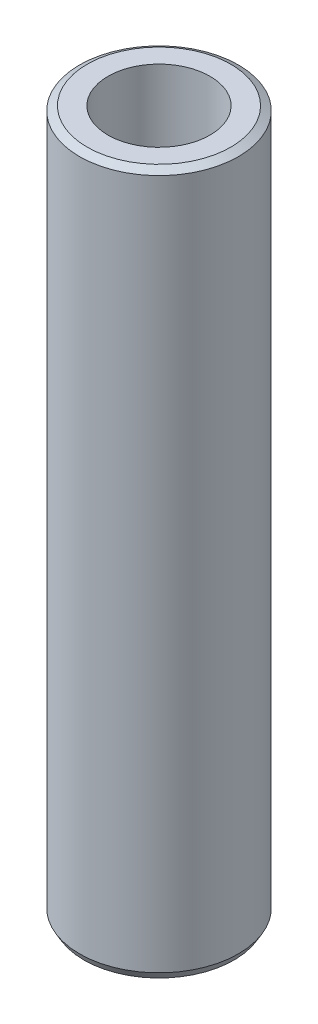
ISO-10303-21;
HEADER;
FILE_DESCRIPTION(('STEP AP214'),'2;1');
FILE_NAME('part.step','',(''),(''),'','','');
FILE_SCHEMA(('AUTOMOTIVE_DESIGN { 1 0 10303 214 1 1 1 1 }'));
ENDSEC;
DATA;
#1=APPLICATION_CONTEXT('core data for automotive mechanical design processes');
#2=APPLICATION_PROTOCOL_DEFINITION('international standard','automotive_design',2000,#1);
#3=PRODUCT_CONTEXT('',#1,'mechanical');
#4=PRODUCT('Part','Part','',(#3));
#5=PRODUCT_RELATED_PRODUCT_CATEGORY('part','',(#4));
#6=PRODUCT_DEFINITION_FORMATION('','',#4);
#7=PRODUCT_DEFINITION_CONTEXT('part definition',#1,'design');
#8=PRODUCT_DEFINITION('design','',#6,#7);
#9=PRODUCT_DEFINITION_SHAPE('','',#8);
#10=(LENGTH_UNIT() NAMED_UNIT(*) SI_UNIT(.MILLI.,.METRE.));
#11=(NAMED_UNIT(*) PLANE_ANGLE_UNIT() SI_UNIT($,.RADIAN.));
#12=(NAMED_UNIT(*) SI_UNIT($,.STERADIAN.) SOLID_ANGLE_UNIT());
#13=UNCERTAINTY_MEASURE_WITH_UNIT(LENGTH_MEASURE(1.E-05),#10,'distance_accuracy_value','');
#14=(GEOMETRIC_REPRESENTATION_CONTEXT(3) GLOBAL_UNCERTAINTY_ASSIGNED_CONTEXT((#13)) GLOBAL_UNIT_ASSIGNED_CONTEXT((#10,
#11,#12)) REPRESENTATION_CONTEXT('',''));
#15=CARTESIAN_POINT('',(0.,0.,0.));
#16=DIRECTION('',(0.,0.,1.));
#17=DIRECTION('',(1.,0.,0.));
#18=AXIS2_PLACEMENT_3D('',#15,#16,#17);
#19=CARTESIAN_POINT('',(0.,397.805296062061,0.));
#20=DIRECTION('',(0.,-1.,0.));
#21=DIRECTION('',(0.,0.,-1.));
#22=AXIS2_PLACEMENT_3D('',#19,#20,#21);
#23=CYLINDRICAL_SURFACE('',#22,45.);
#24=CARTESIAN_POINT('',(0.,395.316054538815,0.));
#25=DIRECTION('',(0.,1.,0.));
#26=DIRECTION('',(0.,0.,1.));
#27=AXIS2_PLACEMENT_3D('',#24,#25,#26);
#28=CIRCLE('',#27,45.);
#29=CARTESIAN_POINT('',(0.,395.316054538815,45.));
#30=VERTEX_POINT('',#29);
#31=EDGE_CURVE('E50',#30,#30,#28,.F.);
#32=ORIENTED_EDGE('',*,*,#31,.T.);
#33=EDGE_LOOP('',(#32));
#34=FACE_BOUND('',#33,.T.);
#35=CARTESIAN_POINT('',(0.,4.31149279057197,0.));
#36=DIRECTION('',(0.,1.,0.));
#37=DIRECTION('',(0.,0.,1.));
#38=AXIS2_PLACEMENT_3D('',#35,#36,#37);
#39=CIRCLE('',#38,45.);
#40=CARTESIAN_POINT('',(0.,4.31149279057197,45.));
#41=VERTEX_POINT('',#40);
#42=EDGE_CURVE('E51',#41,#41,#39,.T.);
#43=ORIENTED_EDGE('',*,*,#42,.T.);
#44=EDGE_LOOP('',(#43));
#45=FACE_BOUND('',#44,.T.);
#46=ADVANCED_FACE('F39',(#34,#45),#23,.T.);
#47=CARTESIAN_POINT('',(0.,397.805296062061,0.));
#48=DIRECTION('',(0.,1.,0.));
#49=DIRECTION('',(0.,0.,1.));
#50=AXIS2_PLACEMENT_3D('',#47,#48,#49);
#51=PLANE('',#50);
#52=CARTESIAN_POINT('',(0.,397.805296062061,0.));
#53=DIRECTION('',(0.,1.,0.));
#54=DIRECTION('',(0.,0.,1.));
#55=AXIS2_PLACEMENT_3D('',#52,#53,#54);
#56=CIRCLE('',#55,40.6885072094281);
#57=CARTESIAN_POINT('',(0.,397.805296062061,40.6885072094281));
#58=VERTEX_POINT('',#57);
#59=EDGE_CURVE('E54',#58,#58,#56,.T.);
#60=ORIENTED_EDGE('',*,*,#59,.T.);
#61=EDGE_LOOP('',(#60));
#62=FACE_BOUND('',#61,.T.);
#63=CARTESIAN_POINT('',(0.,397.805296062061,0.));
#64=DIRECTION('',(0.,1.,0.));
#65=DIRECTION('',(0.,0.,1.));
#66=AXIS2_PLACEMENT_3D('',#63,#64,#65);
#67=CIRCLE('',#66,28.8871732251956);
#68=CARTESIAN_POINT('',(0.,397.805296062061,28.8871732251956));
#69=VERTEX_POINT('',#68);
#70=EDGE_CURVE('E58',#69,#69,#67,.T.);
#71=ORIENTED_EDGE('',*,*,#70,.F.);
#72=EDGE_LOOP('',(#71));
#73=FACE_BOUND('',#72,.T.);
#74=ADVANCED_FACE('F69',(#62,#73),#51,.T.);
#75=CARTESIAN_POINT('',(0.,0.,0.));
#76=DIRECTION('',(0.,1.,0.));
#77=DIRECTION('',(0.,0.,1.));
#78=AXIS2_PLACEMENT_3D('',#75,#76,#77);
#79=PLANE('',#78);
#80=CARTESIAN_POINT('',(0.,0.,0.));
#81=DIRECTION('',(0.,1.,0.));
#82=DIRECTION('',(0.,0.,1.));
#83=AXIS2_PLACEMENT_3D('',#80,#81,#82);
#84=CIRCLE('',#83,42.5107584767541);
#85=CARTESIAN_POINT('',(0.,0.,42.5107584767541));
#86=VERTEX_POINT('',#85);
#87=EDGE_CURVE('E10',#86,#86,#84,.F.);
#88=ORIENTED_EDGE('',*,*,#87,.T.);
#89=EDGE_LOOP('',(#88));
#90=FACE_BOUND('',#89,.T.);
#91=CARTESIAN_POINT('',(0.,0.,0.));
#92=DIRECTION('',(0.,1.,0.));
#93=DIRECTION('',(0.,0.,1.));
#94=AXIS2_PLACEMENT_3D('',#91,#92,#93);
#95=CIRCLE('',#94,28.8871732251956);
#96=CARTESIAN_POINT('',(0.,0.,28.8871732251956));
#97=VERTEX_POINT('',#96);
#98=EDGE_CURVE('E63',#97,#97,#95,.T.);
#99=ORIENTED_EDGE('',*,*,#98,.T.);
#100=EDGE_LOOP('',(#99));
#101=FACE_BOUND('',#100,.T.);
#102=ADVANCED_FACE('F75',(#90,#101),#79,.F.);
#103=CARTESIAN_POINT('',(0.,397.805296062061,0.));
#104=DIRECTION('',(0.,-1.,0.));
#105=DIRECTION('',(0.,0.,-1.));
#106=AXIS2_PLACEMENT_3D('',#103,#104,#105);
#107=CYLINDRICAL_SURFACE('',#106,28.8871732251956);
#108=ORIENTED_EDGE('',*,*,#70,.T.);
#109=EDGE_LOOP('',(#108));
#110=FACE_BOUND('',#109,.T.);
#111=ORIENTED_EDGE('',*,*,#98,.F.);
#112=EDGE_LOOP('',(#111));
#113=FACE_BOUND('',#112,.T.);
#114=ADVANCED_FACE('F70',(#110,#113),#107,.F.);
#115=CARTESIAN_POINT('',(0.,397.805296062061,0.));
#116=DIRECTION('',(0.,-1.,0.));
#117=DIRECTION('',(0.,0.,-1.));
#118=AXIS2_PLACEMENT_3D('',#115,#116,#117);
#119=CONICAL_SURFACE('',#118,40.6885072094281,1.04719755119659);
#120=ORIENTED_EDGE('',*,*,#31,.F.);
#121=EDGE_LOOP('',(#120));
#122=FACE_BOUND('',#121,.T.);
#123=ORIENTED_EDGE('',*,*,#59,.F.);
#124=EDGE_LOOP('',(#123));
#125=FACE_BOUND('',#124,.T.);
#126=ADVANCED_FACE('F81',(#122,#125),#119,.T.);
#127=CARTESIAN_POINT('',(0.,4.31149279057197,0.));
#128=DIRECTION('',(0.,1.,0.));
#129=DIRECTION('',(0.,0.,1.));
#130=AXIS2_PLACEMENT_3D('',#127,#128,#129);
#131=CONICAL_SURFACE('',#130,45.,0.523598775598309);
#132=ORIENTED_EDGE('',*,*,#87,.F.);
#133=EDGE_LOOP('',(#132));
#134=FACE_BOUND('',#133,.T.);
#135=ORIENTED_EDGE('',*,*,#42,.F.);
#136=EDGE_LOOP('',(#135));
#137=FACE_BOUND('',#136,.T.);
#138=ADVANCED_FACE('F45',(#134,#137),#131,.T.);
#139=CLOSED_SHELL('',(#46,#74,#102,#114,#126,#138));
#140=MANIFOLD_SOLID_BREP('B2',#139);
#141=ADVANCED_BREP_SHAPE_REPRESENTATION('',(#18,#140),#14);
#142=SHAPE_DEFINITION_REPRESENTATION(#9,#141);
ENDSEC;
END-ISO-10303-21;
